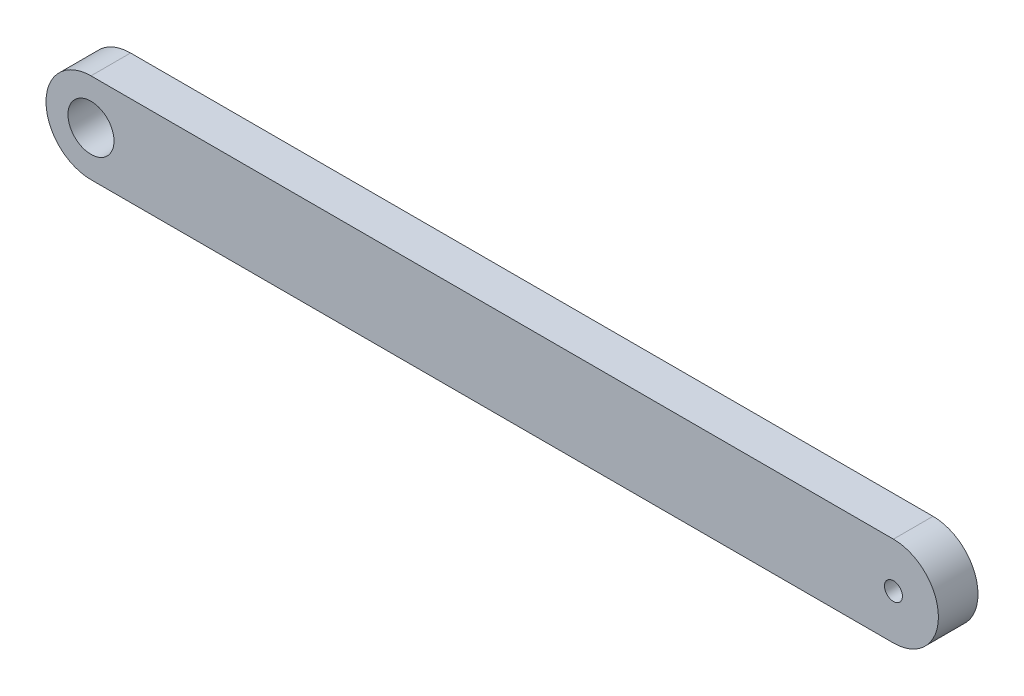
ISO-10303-21;
HEADER;
FILE_DESCRIPTION(('STEP AP214'),'2;1');
FILE_NAME('part.step','',(''),(''),'','','');
FILE_SCHEMA(('AUTOMOTIVE_DESIGN { 1 0 10303 214 1 1 1 1 }'));
ENDSEC;
DATA;
#1=APPLICATION_CONTEXT('core data for automotive mechanical design processes');
#2=APPLICATION_PROTOCOL_DEFINITION('international standard','automotive_design',2000,#1);
#3=PRODUCT_CONTEXT('',#1,'mechanical');
#4=PRODUCT('Part','Part','',(#3));
#5=PRODUCT_RELATED_PRODUCT_CATEGORY('part','',(#4));
#6=PRODUCT_DEFINITION_FORMATION('','',#4);
#7=PRODUCT_DEFINITION_CONTEXT('part definition',#1,'design');
#8=PRODUCT_DEFINITION('design','',#6,#7);
#9=PRODUCT_DEFINITION_SHAPE('','',#8);
#10=(LENGTH_UNIT() NAMED_UNIT(*) SI_UNIT(.MILLI.,.METRE.));
#11=(NAMED_UNIT(*) PLANE_ANGLE_UNIT() SI_UNIT($,.RADIAN.));
#12=(NAMED_UNIT(*) SI_UNIT($,.STERADIAN.) SOLID_ANGLE_UNIT());
#13=UNCERTAINTY_MEASURE_WITH_UNIT(LENGTH_MEASURE(1.E-05),#10,'distance_accuracy_value','');
#14=(GEOMETRIC_REPRESENTATION_CONTEXT(3) GLOBAL_UNCERTAINTY_ASSIGNED_CONTEXT((#13)) GLOBAL_UNIT_ASSIGNED_CONTEXT((#10,
#11,#12)) REPRESENTATION_CONTEXT('',''));
#15=CARTESIAN_POINT('',(0.,0.,0.));
#16=DIRECTION('',(0.,0.,1.));
#17=DIRECTION('',(1.,0.,0.));
#18=AXIS2_PLACEMENT_3D('',#15,#16,#17);
#19=CARTESIAN_POINT('',(0.,0.,2.75));
#20=DIRECTION('',(0.,0.,1.));
#21=DIRECTION('',(1.,0.,0.));
#22=AXIS2_PLACEMENT_3D('',#19,#20,#21);
#23=PLANE('',#22);
#24=CARTESIAN_POINT('',(0.,0.,2.75));
#25=DIRECTION('',(0.,0.,1.));
#26=DIRECTION('',(1.,0.,0.));
#27=AXIS2_PLACEMENT_3D('',#24,#25,#26);
#28=CIRCLE('',#27,1.6);
#29=CARTESIAN_POINT('',(1.6,0.,2.75));
#30=VERTEX_POINT('',#29);
#31=EDGE_CURVE('E104',#30,#30,#28,.T.);
#32=ORIENTED_EDGE('',*,*,#31,.F.);
#33=EDGE_LOOP('',(#32));
#34=FACE_BOUND('',#33,.T.);
#35=CARTESIAN_POINT('',(0.,0.,2.75));
#36=DIRECTION('',(0.,0.,1.));
#37=DIRECTION('',(1.,0.,0.));
#38=AXIS2_PLACEMENT_3D('',#35,#36,#37);
#39=CIRCLE('',#38,3.125);
#40=CARTESIAN_POINT('',(0.,3.125,2.75));
#41=VERTEX_POINT('',#40);
#42=CARTESIAN_POINT('',(0.,-3.125,2.75));
#43=VERTEX_POINT('',#42);
#44=EDGE_CURVE('E89',#41,#43,#39,.T.);
#45=ORIENTED_EDGE('',*,*,#44,.T.);
#46=DIRECTION('',(1.,0.,0.));
#47=VECTOR('',#46,1.);
#48=CARTESIAN_POINT('',(0.,-3.125,2.75));
#49=LINE('',#48,#47);
#50=CARTESIAN_POINT('',(55.75,-3.125,2.75));
#51=VERTEX_POINT('',#50);
#52=EDGE_CURVE('E84',#43,#51,#49,.T.);
#53=ORIENTED_EDGE('',*,*,#52,.T.);
#54=CARTESIAN_POINT('',(55.75,0.,2.75));
#55=DIRECTION('',(0.,0.,1.));
#56=DIRECTION('',(1.,0.,0.));
#57=AXIS2_PLACEMENT_3D('',#54,#55,#56);
#58=CIRCLE('',#57,3.125);
#59=CARTESIAN_POINT('',(55.75,3.125,2.75));
#60=VERTEX_POINT('',#59);
#61=EDGE_CURVE('E87',#51,#60,#58,.T.);
#62=ORIENTED_EDGE('',*,*,#61,.T.);
#63=DIRECTION('',(-1.,0.,0.));
#64=VECTOR('',#63,1.);
#65=CARTESIAN_POINT('',(0.,3.125,2.75));
#66=LINE('',#65,#64);
#67=EDGE_CURVE('E54',#60,#41,#66,.T.);
#68=ORIENTED_EDGE('',*,*,#67,.T.);
#69=EDGE_LOOP('',(#45,#53,#62,#68));
#70=FACE_BOUND('',#69,.T.);
#71=CARTESIAN_POINT('',(55.75,0.,2.75));
#72=DIRECTION('',(0.,0.,1.));
#73=DIRECTION('',(1.,0.,0.));
#74=AXIS2_PLACEMENT_3D('',#71,#72,#73);
#75=CIRCLE('',#74,0.625000000000006);
#76=CARTESIAN_POINT('',(56.375,0.,2.75));
#77=VERTEX_POINT('',#76);
#78=EDGE_CURVE('E119',#77,#77,#75,.T.);
#79=ORIENTED_EDGE('',*,*,#78,.F.);
#80=EDGE_LOOP('',(#79));
#81=FACE_BOUND('',#80,.T.);
#82=ADVANCED_FACE('F37',(#34,#70,#81),#23,.T.);
#83=CARTESIAN_POINT('',(0.,0.,0.));
#84=DIRECTION('',(0.,0.,1.));
#85=DIRECTION('',(1.,0.,0.));
#86=AXIS2_PLACEMENT_3D('',#83,#84,#85);
#87=PLANE('',#86);
#88=CARTESIAN_POINT('',(0.,0.,0.));
#89=DIRECTION('',(0.,0.,1.));
#90=DIRECTION('',(1.,0.,0.));
#91=AXIS2_PLACEMENT_3D('',#88,#89,#90);
#92=CIRCLE('',#91,3.125);
#93=CARTESIAN_POINT('',(0.,3.125,0.));
#94=VERTEX_POINT('',#93);
#95=CARTESIAN_POINT('',(0.,-3.125,0.));
#96=VERTEX_POINT('',#95);
#97=EDGE_CURVE('E101',#94,#96,#92,.T.);
#98=ORIENTED_EDGE('',*,*,#97,.F.);
#99=DIRECTION('',(-1.,0.,0.));
#100=VECTOR('',#99,1.);
#101=CARTESIAN_POINT('',(0.,3.125,0.));
#102=LINE('',#101,#100);
#103=CARTESIAN_POINT('',(55.75,3.125,0.));
#104=VERTEX_POINT('',#103);
#105=EDGE_CURVE('E77',#104,#94,#102,.T.);
#106=ORIENTED_EDGE('',*,*,#105,.F.);
#107=CARTESIAN_POINT('',(55.75,0.,0.));
#108=DIRECTION('',(0.,0.,1.));
#109=DIRECTION('',(1.,0.,0.));
#110=AXIS2_PLACEMENT_3D('',#107,#108,#109);
#111=CIRCLE('',#110,3.125);
#112=CARTESIAN_POINT('',(55.75,-3.125,0.));
#113=VERTEX_POINT('',#112);
#114=EDGE_CURVE('E71',#113,#104,#111,.T.);
#115=ORIENTED_EDGE('',*,*,#114,.F.);
#116=DIRECTION('',(1.,0.,0.));
#117=VECTOR('',#116,1.);
#118=CARTESIAN_POINT('',(0.,-3.125,0.));
#119=LINE('',#118,#117);
#120=EDGE_CURVE('E93',#96,#113,#119,.T.);
#121=ORIENTED_EDGE('',*,*,#120,.F.);
#122=EDGE_LOOP('',(#98,#106,#115,#121));
#123=FACE_BOUND('',#122,.T.);
#124=CARTESIAN_POINT('',(0.,0.,0.));
#125=DIRECTION('',(0.,0.,1.));
#126=DIRECTION('',(1.,0.,0.));
#127=AXIS2_PLACEMENT_3D('',#124,#125,#126);
#128=CIRCLE('',#127,1.6);
#129=CARTESIAN_POINT('',(1.6,0.,0.));
#130=VERTEX_POINT('',#129);
#131=EDGE_CURVE('E116',#130,#130,#128,.T.);
#132=ORIENTED_EDGE('',*,*,#131,.T.);
#133=EDGE_LOOP('',(#132));
#134=FACE_BOUND('',#133,.T.);
#135=CARTESIAN_POINT('',(55.75,0.,0.));
#136=DIRECTION('',(0.,0.,1.));
#137=DIRECTION('',(1.,0.,0.));
#138=AXIS2_PLACEMENT_3D('',#135,#136,#137);
#139=CIRCLE('',#138,0.625000000000006);
#140=CARTESIAN_POINT('',(56.375,0.,0.));
#141=VERTEX_POINT('',#140);
#142=EDGE_CURVE('E122',#141,#141,#139,.T.);
#143=ORIENTED_EDGE('',*,*,#142,.T.);
#144=EDGE_LOOP('',(#143));
#145=FACE_BOUND('',#144,.T.);
#146=ADVANCED_FACE('F112',(#123,#134,#145),#87,.F.);
#147=CARTESIAN_POINT('',(0.,0.,2.75));
#148=DIRECTION('',(0.,0.,-1.));
#149=DIRECTION('',(-1.,0.,0.));
#150=AXIS2_PLACEMENT_3D('',#147,#148,#149);
#151=CYLINDRICAL_SURFACE('',#150,3.125);
#152=ORIENTED_EDGE('',*,*,#97,.T.);
#153=DIRECTION('',(0.,0.,-1.));
#154=VECTOR('',#153,1.);
#155=CARTESIAN_POINT('',(0.,-3.125,2.75));
#156=LINE('',#155,#154);
#157=EDGE_CURVE('E11',#43,#96,#156,.T.);
#158=ORIENTED_EDGE('',*,*,#157,.F.);
#159=ORIENTED_EDGE('',*,*,#44,.F.);
#160=DIRECTION('',(0.,0.,-1.));
#161=VECTOR('',#160,1.);
#162=CARTESIAN_POINT('',(0.,3.125,2.75));
#163=LINE('',#162,#161);
#164=EDGE_CURVE('E97',#41,#94,#163,.T.);
#165=ORIENTED_EDGE('',*,*,#164,.T.);
#166=EDGE_LOOP('',(#152,#158,#159,#165));
#167=FACE_BOUND('',#166,.T.);
#168=ADVANCED_FACE('F39',(#167),#151,.T.);
#169=CARTESIAN_POINT('',(0.,-3.125,2.75));
#170=DIRECTION('',(0.,1.,0.));
#171=DIRECTION('',(0.,0.,1.));
#172=AXIS2_PLACEMENT_3D('',#169,#170,#171);
#173=PLANE('',#172);
#174=ORIENTED_EDGE('',*,*,#120,.T.);
#175=DIRECTION('',(0.,0.,-1.));
#176=VECTOR('',#175,1.);
#177=CARTESIAN_POINT('',(55.75,-3.125,2.75));
#178=LINE('',#177,#176);
#179=EDGE_CURVE('E46',#51,#113,#178,.T.);
#180=ORIENTED_EDGE('',*,*,#179,.F.);
#181=ORIENTED_EDGE('',*,*,#52,.F.);
#182=ORIENTED_EDGE('',*,*,#157,.T.);
#183=EDGE_LOOP('',(#174,#180,#181,#182));
#184=FACE_BOUND('',#183,.T.);
#185=ADVANCED_FACE('F92',(#184),#173,.F.);
#186=CARTESIAN_POINT('',(55.75,0.,2.75));
#187=DIRECTION('',(0.,0.,-1.));
#188=DIRECTION('',(-1.,0.,0.));
#189=AXIS2_PLACEMENT_3D('',#186,#187,#188);
#190=CYLINDRICAL_SURFACE('',#189,3.125);
#191=ORIENTED_EDGE('',*,*,#114,.T.);
#192=DIRECTION('',(0.,0.,-1.));
#193=VECTOR('',#192,1.);
#194=CARTESIAN_POINT('',(55.75,3.125,2.75));
#195=LINE('',#194,#193);
#196=EDGE_CURVE('E94',#60,#104,#195,.T.);
#197=ORIENTED_EDGE('',*,*,#196,.F.);
#198=ORIENTED_EDGE('',*,*,#61,.F.);
#199=ORIENTED_EDGE('',*,*,#179,.T.);
#200=EDGE_LOOP('',(#191,#197,#198,#199));
#201=FACE_BOUND('',#200,.T.);
#202=ADVANCED_FACE('F95',(#201),#190,.T.);
#203=CARTESIAN_POINT('',(0.,3.125,2.75));
#204=DIRECTION('',(0.,-1.,0.));
#205=DIRECTION('',(0.,0.,-1.));
#206=AXIS2_PLACEMENT_3D('',#203,#204,#205);
#207=PLANE('',#206);
#208=ORIENTED_EDGE('',*,*,#105,.T.);
#209=ORIENTED_EDGE('',*,*,#164,.F.);
#210=ORIENTED_EDGE('',*,*,#67,.F.);
#211=ORIENTED_EDGE('',*,*,#196,.T.);
#212=EDGE_LOOP('',(#208,#209,#210,#211));
#213=FACE_BOUND('',#212,.T.);
#214=ADVANCED_FACE('F109',(#213),#207,.F.);
#215=CARTESIAN_POINT('',(0.,0.,2.75));
#216=DIRECTION('',(0.,0.,-1.));
#217=DIRECTION('',(-1.,0.,0.));
#218=AXIS2_PLACEMENT_3D('',#215,#216,#217);
#219=CYLINDRICAL_SURFACE('',#218,1.6);
#220=ORIENTED_EDGE('',*,*,#31,.T.);
#221=EDGE_LOOP('',(#220));
#222=FACE_BOUND('',#221,.T.);
#223=ORIENTED_EDGE('',*,*,#131,.F.);
#224=EDGE_LOOP('',(#223));
#225=FACE_BOUND('',#224,.T.);
#226=ADVANCED_FACE('F139',(#222,#225),#219,.F.);
#227=CARTESIAN_POINT('',(55.75,0.,2.75));
#228=DIRECTION('',(0.,0.,-1.));
#229=DIRECTION('',(-1.,0.,0.));
#230=AXIS2_PLACEMENT_3D('',#227,#228,#229);
#231=CYLINDRICAL_SURFACE('',#230,0.625000000000006);
#232=ORIENTED_EDGE('',*,*,#78,.T.);
#233=EDGE_LOOP('',(#232));
#234=FACE_BOUND('',#233,.T.);
#235=ORIENTED_EDGE('',*,*,#142,.F.);
#236=EDGE_LOOP('',(#235));
#237=FACE_BOUND('',#236,.T.);
#238=ADVANCED_FACE('F128',(#234,#237),#231,.F.);
#239=CLOSED_SHELL('',(#82,#146,#168,#185,#202,#214,#226,#238));
#240=MANIFOLD_SOLID_BREP('B2',#239);
#241=ADVANCED_BREP_SHAPE_REPRESENTATION('',(#18,#240),#14);
#242=SHAPE_DEFINITION_REPRESENTATION(#9,#241);
ENDSEC;
END-ISO-10303-21;
